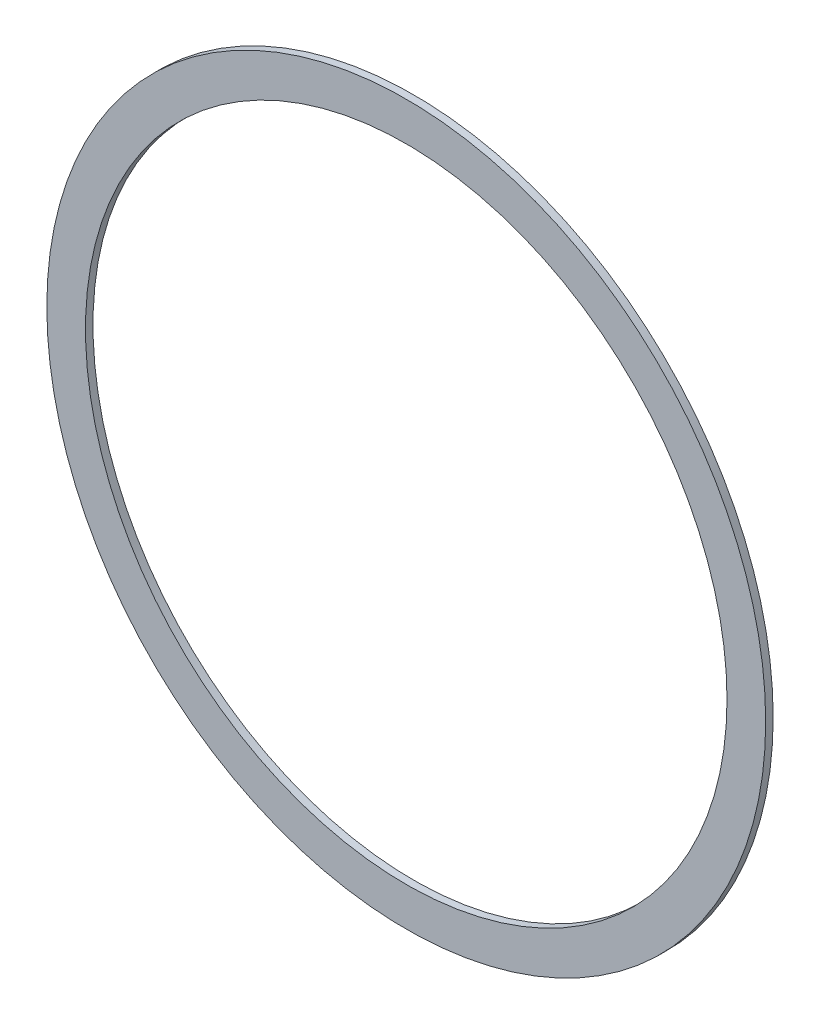
ISO-10303-21;
HEADER;
FILE_DESCRIPTION(('STEP AP214'),'2;1');
FILE_NAME('part.step','',(''),(''),'','','');
FILE_SCHEMA(('AUTOMOTIVE_DESIGN { 1 0 10303 214 1 1 1 1 }'));
ENDSEC;
DATA;
#1=APPLICATION_CONTEXT('core data for automotive mechanical design processes');
#2=APPLICATION_PROTOCOL_DEFINITION('international standard','automotive_design',2000,#1);
#3=PRODUCT_CONTEXT('',#1,'mechanical');
#4=PRODUCT('Part','Part','',(#3));
#5=PRODUCT_RELATED_PRODUCT_CATEGORY('part','',(#4));
#6=PRODUCT_DEFINITION_FORMATION('','',#4);
#7=PRODUCT_DEFINITION_CONTEXT('part definition',#1,'design');
#8=PRODUCT_DEFINITION('design','',#6,#7);
#9=PRODUCT_DEFINITION_SHAPE('','',#8);
#10=(LENGTH_UNIT() NAMED_UNIT(*) SI_UNIT(.MILLI.,.METRE.));
#11=(NAMED_UNIT(*) PLANE_ANGLE_UNIT() SI_UNIT($,.RADIAN.));
#12=(NAMED_UNIT(*) SI_UNIT($,.STERADIAN.) SOLID_ANGLE_UNIT());
#13=UNCERTAINTY_MEASURE_WITH_UNIT(LENGTH_MEASURE(1.E-05),#10,'distance_accuracy_value','');
#14=(GEOMETRIC_REPRESENTATION_CONTEXT(3) GLOBAL_UNCERTAINTY_ASSIGNED_CONTEXT((#13)) GLOBAL_UNIT_ASSIGNED_CONTEXT((#10,
#11,#12)) REPRESENTATION_CONTEXT('',''));
#15=CARTESIAN_POINT('',(0.,0.,0.));
#16=DIRECTION('',(0.,0.,1.));
#17=DIRECTION('',(1.,0.,0.));
#18=AXIS2_PLACEMENT_3D('',#15,#16,#17);
#19=CARTESIAN_POINT('',(0.,0.,0.396875));
#20=DIRECTION('',(0.,0.,1.));
#21=DIRECTION('',(1.,0.,0.));
#22=AXIS2_PLACEMENT_3D('',#19,#20,#21);
#23=PLANE('',#22);
#24=CARTESIAN_POINT('',(0.,0.,0.396875));
#25=DIRECTION('',(0.,0.,1.));
#26=DIRECTION('',(1.,0.,0.));
#27=AXIS2_PLACEMENT_3D('',#24,#25,#26);
#28=CIRCLE('',#27,19.05);
#29=CARTESIAN_POINT('',(19.05,0.,0.396875));
#30=VERTEX_POINT('',#29);
#31=EDGE_CURVE('E10',#30,#30,#28,.T.);
#32=ORIENTED_EDGE('',*,*,#31,.T.);
#33=EDGE_LOOP('',(#32));
#34=FACE_BOUND('',#33,.T.);
#35=CARTESIAN_POINT('',(0.,0.,0.396875));
#36=DIRECTION('',(0.,0.,1.));
#37=DIRECTION('',(1.,0.,0.));
#38=AXIS2_PLACEMENT_3D('',#35,#36,#37);
#39=CIRCLE('',#38,17.);
#40=CARTESIAN_POINT('',(17.,0.,0.396875));
#41=VERTEX_POINT('',#40);
#42=EDGE_CURVE('E44',#41,#41,#39,.T.);
#43=ORIENTED_EDGE('',*,*,#42,.F.);
#44=EDGE_LOOP('',(#43));
#45=FACE_BOUND('',#44,.T.);
#46=ADVANCED_FACE('F33',(#34,#45),#23,.T.);
#47=CARTESIAN_POINT('',(0.,0.,0.));
#48=DIRECTION('',(0.,0.,1.));
#49=DIRECTION('',(1.,0.,0.));
#50=AXIS2_PLACEMENT_3D('',#47,#48,#49);
#51=PLANE('',#50);
#52=CARTESIAN_POINT('',(0.,0.,0.));
#53=DIRECTION('',(0.,0.,1.));
#54=DIRECTION('',(1.,0.,0.));
#55=AXIS2_PLACEMENT_3D('',#52,#53,#54);
#56=CIRCLE('',#55,19.05);
#57=CARTESIAN_POINT('',(19.05,0.,0.));
#58=VERTEX_POINT('',#57);
#59=EDGE_CURVE('E37',#58,#58,#56,.T.);
#60=ORIENTED_EDGE('',*,*,#59,.F.);
#61=EDGE_LOOP('',(#60));
#62=FACE_BOUND('',#61,.T.);
#63=CARTESIAN_POINT('',(0.,0.,0.));
#64=DIRECTION('',(0.,0.,1.));
#65=DIRECTION('',(1.,0.,0.));
#66=AXIS2_PLACEMENT_3D('',#63,#64,#65);
#67=CIRCLE('',#66,17.);
#68=CARTESIAN_POINT('',(17.,0.,0.));
#69=VERTEX_POINT('',#68);
#70=EDGE_CURVE('E46',#69,#69,#67,.T.);
#71=ORIENTED_EDGE('',*,*,#70,.T.);
#72=EDGE_LOOP('',(#71));
#73=FACE_BOUND('',#72,.T.);
#74=ADVANCED_FACE('F56',(#62,#73),#51,.F.);
#75=CARTESIAN_POINT('',(0.,0.,0.396875));
#76=DIRECTION('',(0.,0.,-1.));
#77=DIRECTION('',(-1.,0.,0.));
#78=AXIS2_PLACEMENT_3D('',#75,#76,#77);
#79=CYLINDRICAL_SURFACE('',#78,19.05);
#80=ORIENTED_EDGE('',*,*,#31,.F.);
#81=EDGE_LOOP('',(#80));
#82=FACE_BOUND('',#81,.T.);
#83=ORIENTED_EDGE('',*,*,#59,.T.);
#84=EDGE_LOOP('',(#83));
#85=FACE_BOUND('',#84,.T.);
#86=ADVANCED_FACE('F35',(#82,#85),#79,.T.);
#87=CARTESIAN_POINT('',(0.,0.,0.396875));
#88=DIRECTION('',(0.,0.,-1.));
#89=DIRECTION('',(-1.,0.,0.));
#90=AXIS2_PLACEMENT_3D('',#87,#88,#89);
#91=CYLINDRICAL_SURFACE('',#90,17.);
#92=ORIENTED_EDGE('',*,*,#42,.T.);
#93=EDGE_LOOP('',(#92));
#94=FACE_BOUND('',#93,.T.);
#95=ORIENTED_EDGE('',*,*,#70,.F.);
#96=EDGE_LOOP('',(#95));
#97=FACE_BOUND('',#96,.T.);
#98=ADVANCED_FACE('F52',(#94,#97),#91,.F.);
#99=CLOSED_SHELL('',(#46,#74,#86,#98));
#100=MANIFOLD_SOLID_BREP('B2',#99);
#101=ADVANCED_BREP_SHAPE_REPRESENTATION('',(#18,#100),#14);
#102=SHAPE_DEFINITION_REPRESENTATION(#9,#101);
ENDSEC;
END-ISO-10303-21;
